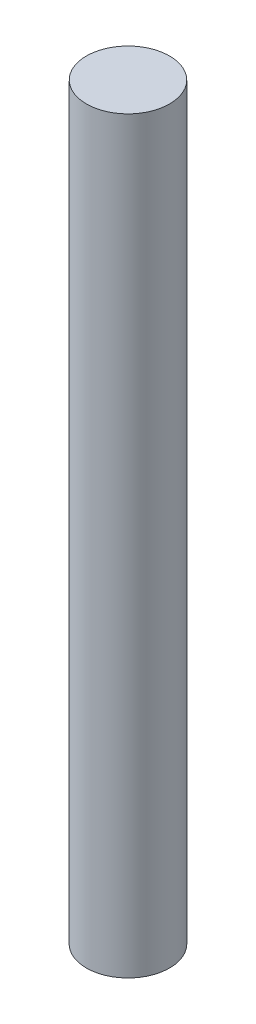
ISO-10303-21;
HEADER;
FILE_DESCRIPTION(('STEP AP214'),'2;1');
FILE_NAME('part.step','',(''),(''),'','','');
FILE_SCHEMA(('AUTOMOTIVE_DESIGN { 1 0 10303 214 1 1 1 1 }'));
ENDSEC;
DATA;
#1=APPLICATION_CONTEXT('core data for automotive mechanical design processes');
#2=APPLICATION_PROTOCOL_DEFINITION('international standard','automotive_design',2000,#1);
#3=PRODUCT_CONTEXT('',#1,'mechanical');
#4=PRODUCT('Part','Part','',(#3));
#5=PRODUCT_RELATED_PRODUCT_CATEGORY('part','',(#4));
#6=PRODUCT_DEFINITION_FORMATION('','',#4);
#7=PRODUCT_DEFINITION_CONTEXT('part definition',#1,'design');
#8=PRODUCT_DEFINITION('design','',#6,#7);
#9=PRODUCT_DEFINITION_SHAPE('','',#8);
#10=(LENGTH_UNIT() NAMED_UNIT(*) SI_UNIT(.MILLI.,.METRE.));
#11=(NAMED_UNIT(*) PLANE_ANGLE_UNIT() SI_UNIT($,.RADIAN.));
#12=(NAMED_UNIT(*) SI_UNIT($,.STERADIAN.) SOLID_ANGLE_UNIT());
#13=UNCERTAINTY_MEASURE_WITH_UNIT(LENGTH_MEASURE(1.E-05),#10,'distance_accuracy_value','');
#14=(GEOMETRIC_REPRESENTATION_CONTEXT(3) GLOBAL_UNCERTAINTY_ASSIGNED_CONTEXT((#13)) GLOBAL_UNIT_ASSIGNED_CONTEXT((#10,
#11,#12)) REPRESENTATION_CONTEXT('',''));
#15=CARTESIAN_POINT('',(0.,0.,0.));
#16=DIRECTION('',(0.,0.,1.));
#17=DIRECTION('',(1.,0.,0.));
#18=AXIS2_PLACEMENT_3D('',#15,#16,#17);
#19=CARTESIAN_POINT('',(0.,45.,0.));
#20=DIRECTION('',(0.,-1.,0.));
#21=DIRECTION('',(0.,0.,-1.));
#22=AXIS2_PLACEMENT_3D('',#19,#20,#21);
#23=CYLINDRICAL_SURFACE('',#22,2.5);
#24=CARTESIAN_POINT('',(0.,45.,0.));
#25=DIRECTION('',(0.,1.,0.));
#26=DIRECTION('',(0.,0.,1.));
#27=AXIS2_PLACEMENT_3D('',#24,#25,#26);
#28=CIRCLE('',#27,2.5);
#29=CARTESIAN_POINT('',(0.,45.,2.5));
#30=VERTEX_POINT('',#29);
#31=EDGE_CURVE('E10',#30,#30,#28,.T.);
#32=ORIENTED_EDGE('',*,*,#31,.F.);
#33=EDGE_LOOP('',(#32));
#34=FACE_BOUND('',#33,.T.);
#35=CARTESIAN_POINT('',(0.,0.,0.));
#36=DIRECTION('',(0.,1.,0.));
#37=DIRECTION('',(0.,0.,1.));
#38=AXIS2_PLACEMENT_3D('',#35,#36,#37);
#39=CIRCLE('',#38,2.5);
#40=CARTESIAN_POINT('',(0.,0.,2.5));
#41=VERTEX_POINT('',#40);
#42=EDGE_CURVE('E40',#41,#41,#39,.T.);
#43=ORIENTED_EDGE('',*,*,#42,.T.);
#44=EDGE_LOOP('',(#43));
#45=FACE_BOUND('',#44,.T.);
#46=ADVANCED_FACE('F37',(#34,#45),#23,.T.);
#47=CARTESIAN_POINT('',(0.,45.,0.));
#48=DIRECTION('',(0.,1.,0.));
#49=DIRECTION('',(0.,0.,1.));
#50=AXIS2_PLACEMENT_3D('',#47,#48,#49);
#51=PLANE('',#50);
#52=ORIENTED_EDGE('',*,*,#31,.T.);
#53=EDGE_LOOP('',(#52));
#54=FACE_BOUND('',#53,.T.);
#55=ADVANCED_FACE('F54',(#54),#51,.T.);
#56=CARTESIAN_POINT('',(0.,0.,0.));
#57=DIRECTION('',(0.,1.,0.));
#58=DIRECTION('',(0.,0.,1.));
#59=AXIS2_PLACEMENT_3D('',#56,#57,#58);
#60=PLANE('',#59);
#61=ORIENTED_EDGE('',*,*,#42,.F.);
#62=EDGE_LOOP('',(#61));
#63=FACE_BOUND('',#62,.T.);
#64=ADVANCED_FACE('F52',(#63),#60,.F.);
#65=CLOSED_SHELL('',(#46,#55,#64));
#66=MANIFOLD_SOLID_BREP('B2',#65);
#67=ADVANCED_BREP_SHAPE_REPRESENTATION('',(#18,#66),#14);
#68=SHAPE_DEFINITION_REPRESENTATION(#9,#67);
ENDSEC;
END-ISO-10303-21;
